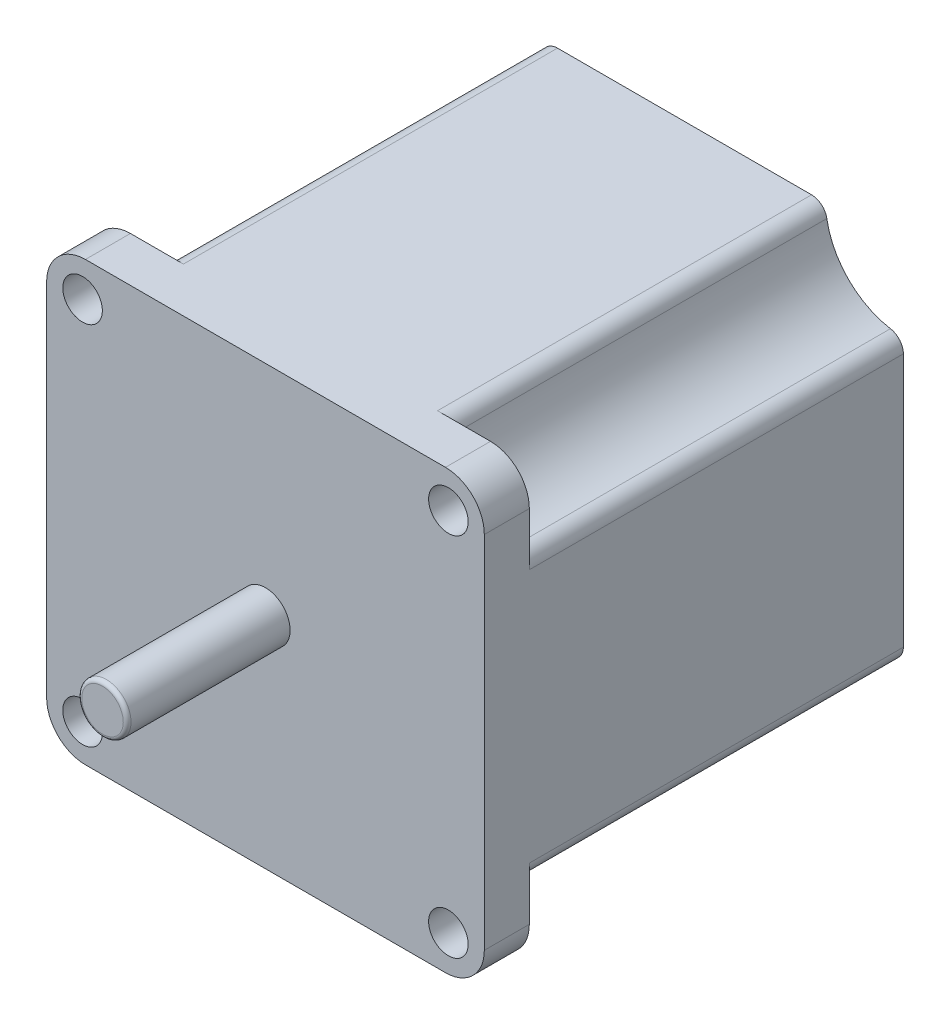
ISO-10303-21;
HEADER;
FILE_DESCRIPTION(('STEP AP214'),'2;1');
FILE_NAME('part.step','',(''),(''),'','','');
FILE_SCHEMA(('AUTOMOTIVE_DESIGN { 1 0 10303 214 1 1 1 1 }'));
ENDSEC;
DATA;
#1=APPLICATION_CONTEXT('core data for automotive mechanical design processes');
#2=APPLICATION_PROTOCOL_DEFINITION('international standard','automotive_design',2000,#1);
#3=PRODUCT_CONTEXT('',#1,'mechanical');
#4=PRODUCT('Part','Part','',(#3));
#5=PRODUCT_RELATED_PRODUCT_CATEGORY('part','',(#4));
#6=PRODUCT_DEFINITION_FORMATION('','',#4);
#7=PRODUCT_DEFINITION_CONTEXT('part definition',#1,'design');
#8=PRODUCT_DEFINITION('design','',#6,#7);
#9=PRODUCT_DEFINITION_SHAPE('','',#8);
#10=(LENGTH_UNIT() NAMED_UNIT(*) SI_UNIT(.MILLI.,.METRE.));
#11=(NAMED_UNIT(*) PLANE_ANGLE_UNIT() SI_UNIT($,.RADIAN.));
#12=(NAMED_UNIT(*) SI_UNIT($,.STERADIAN.) SOLID_ANGLE_UNIT());
#13=UNCERTAINTY_MEASURE_WITH_UNIT(LENGTH_MEASURE(1.E-05),#10,'distance_accuracy_value','');
#14=(GEOMETRIC_REPRESENTATION_CONTEXT(3) GLOBAL_UNCERTAINTY_ASSIGNED_CONTEXT((#13)) GLOBAL_UNIT_ASSIGNED_CONTEXT((#10,
#11,#12)) REPRESENTATION_CONTEXT('',''));
#15=CARTESIAN_POINT('',(0.,0.,0.));
#16=DIRECTION('',(0.,0.,1.));
#17=DIRECTION('',(1.,0.,0.));
#18=AXIS2_PLACEMENT_3D('',#15,#16,#17);
#19=CARTESIAN_POINT('',(0.,0.,54.));
#20=DIRECTION('',(0.,0.,-1.));
#21=DIRECTION('',(-1.,0.,0.));
#22=AXIS2_PLACEMENT_3D('',#19,#20,#21);
#23=PLANE('',#22);
#24=DIRECTION('',(0.,-1.,0.));
#25=VECTOR('',#24,1.);
#26=CARTESIAN_POINT('',(-28.2,28.2,54.));
#27=LINE('',#26,#25);
#28=CARTESIAN_POINT('',(-28.2,23.2,54.));
#29=VERTEX_POINT('',#28);
#30=CARTESIAN_POINT('',(-28.2,-23.2,54.));
#31=VERTEX_POINT('',#30);
#32=EDGE_CURVE('E518',#29,#31,#27,.T.);
#33=ORIENTED_EDGE('',*,*,#32,.T.);
#34=CARTESIAN_POINT('',(-23.2,-23.2,54.));
#35=DIRECTION('',(0.,0.,-1.));
#36=DIRECTION('',(-1.,0.,0.));
#37=AXIS2_PLACEMENT_3D('',#34,#35,#36);
#38=CIRCLE('',#37,5.);
#39=CARTESIAN_POINT('',(-23.2,-28.2,54.));
#40=VERTEX_POINT('',#39);
#41=EDGE_CURVE('E263',#31,#40,#38,.F.);
#42=ORIENTED_EDGE('',*,*,#41,.T.);
#43=DIRECTION('',(1.,0.,0.));
#44=VECTOR('',#43,1.);
#45=CARTESIAN_POINT('',(28.2,-28.2,54.));
#46=LINE('',#45,#44);
#47=CARTESIAN_POINT('',(23.2,-28.2,54.));
#48=VERTEX_POINT('',#47);
#49=EDGE_CURVE('E520',#40,#48,#46,.T.);
#50=ORIENTED_EDGE('',*,*,#49,.T.);
#51=CARTESIAN_POINT('',(23.2,-23.2,54.));
#52=DIRECTION('',(0.,0.,-1.));
#53=DIRECTION('',(-1.,0.,0.));
#54=AXIS2_PLACEMENT_3D('',#51,#52,#53);
#55=CIRCLE('',#54,5.);
#56=CARTESIAN_POINT('',(28.2,-23.2,54.));
#57=VERTEX_POINT('',#56);
#58=EDGE_CURVE('E243',#48,#57,#55,.F.);
#59=ORIENTED_EDGE('',*,*,#58,.T.);
#60=DIRECTION('',(0.,1.,0.));
#61=VECTOR('',#60,1.);
#62=CARTESIAN_POINT('',(28.2,28.2,54.));
#63=LINE('',#62,#61);
#64=CARTESIAN_POINT('',(28.2,23.2,54.));
#65=VERTEX_POINT('',#64);
#66=EDGE_CURVE('E511',#57,#65,#63,.T.);
#67=ORIENTED_EDGE('',*,*,#66,.T.);
#68=CARTESIAN_POINT('',(23.2,23.2,54.));
#69=DIRECTION('',(0.,0.,-1.));
#70=DIRECTION('',(-1.,0.,0.));
#71=AXIS2_PLACEMENT_3D('',#68,#69,#70);
#72=CIRCLE('',#71,5.);
#73=CARTESIAN_POINT('',(23.2,28.2,54.));
#74=VERTEX_POINT('',#73);
#75=EDGE_CURVE('E248',#65,#74,#72,.F.);
#76=ORIENTED_EDGE('',*,*,#75,.T.);
#77=DIRECTION('',(-1.,0.,0.));
#78=VECTOR('',#77,1.);
#79=CARTESIAN_POINT('',(28.2,28.2,54.));
#80=LINE('',#79,#78);
#81=CARTESIAN_POINT('',(-23.2,28.2,54.));
#82=VERTEX_POINT('',#81);
#83=EDGE_CURVE('E514',#74,#82,#80,.T.);
#84=ORIENTED_EDGE('',*,*,#83,.T.);
#85=CARTESIAN_POINT('',(-23.2,23.2,54.));
#86=DIRECTION('',(0.,0.,-1.));
#87=DIRECTION('',(-1.,0.,0.));
#88=AXIS2_PLACEMENT_3D('',#85,#86,#87);
#89=CIRCLE('',#88,5.);
#90=EDGE_CURVE('E256',#82,#29,#89,.F.);
#91=ORIENTED_EDGE('',*,*,#90,.T.);
#92=EDGE_LOOP('',(#33,#42,#50,#59,#67,#76,#84,#91));
#93=FACE_BOUND('',#92,.T.);
#94=CARTESIAN_POINT('',(-23.57,23.57,54.));
#95=DIRECTION('',(0.,0.,1.));
#96=DIRECTION('',(1.,0.,0.));
#97=AXIS2_PLACEMENT_3D('',#94,#95,#96);
#98=CIRCLE('',#97,2.55);
#99=CARTESIAN_POINT('',(-21.02,23.57,54.));
#100=VERTEX_POINT('',#99);
#101=EDGE_CURVE('E507',#100,#100,#98,.T.);
#102=ORIENTED_EDGE('',*,*,#101,.F.);
#103=EDGE_LOOP('',(#102));
#104=FACE_BOUND('',#103,.T.);
#105=CARTESIAN_POINT('',(23.57,23.5700000000013,54.));
#106=DIRECTION('',(0.,0.,1.));
#107=DIRECTION('',(1.,0.,0.));
#108=AXIS2_PLACEMENT_3D('',#105,#106,#107);
#109=CIRCLE('',#108,2.55000000000138);
#110=CARTESIAN_POINT('',(26.1200000000014,23.5700000000013,54.));
#111=VERTEX_POINT('',#110);
#112=EDGE_CURVE('E504',#111,#111,#109,.T.);
#113=ORIENTED_EDGE('',*,*,#112,.F.);
#114=EDGE_LOOP('',(#113));
#115=FACE_BOUND('',#114,.T.);
#116=CARTESIAN_POINT('',(23.5700000000013,-23.5699999999987,54.));
#117=DIRECTION('',(0.,0.,1.));
#118=DIRECTION('',(1.,0.,0.));
#119=AXIS2_PLACEMENT_3D('',#116,#117,#118);
#120=CIRCLE('',#119,2.55000000000187);
#121=CARTESIAN_POINT('',(26.1200000000032,-23.5699999999987,54.));
#122=VERTEX_POINT('',#121);
#123=EDGE_CURVE('E501',#122,#122,#120,.T.);
#124=ORIENTED_EDGE('',*,*,#123,.F.);
#125=EDGE_LOOP('',(#124));
#126=FACE_BOUND('',#125,.T.);
#127=CARTESIAN_POINT('',(-23.5699999999987,-23.57,54.));
#128=DIRECTION('',(0.,0.,1.));
#129=DIRECTION('',(1.,0.,0.));
#130=AXIS2_PLACEMENT_3D('',#127,#128,#129);
#131=CIRCLE('',#130,2.5500000000007);
#132=CARTESIAN_POINT('',(-21.019999999998,-23.57,54.));
#133=VERTEX_POINT('',#132);
#134=EDGE_CURVE('E498',#133,#133,#131,.T.);
#135=ORIENTED_EDGE('',*,*,#134,.F.);
#136=EDGE_LOOP('',(#135));
#137=FACE_BOUND('',#136,.T.);
#138=CARTESIAN_POINT('',(0.,0.,54.));
#139=DIRECTION('',(0.,0.,-1.));
#140=DIRECTION('',(-1.,0.,0.));
#141=AXIS2_PLACEMENT_3D('',#138,#139,#140);
#142=CIRCLE('',#141,3.175);
#143=CARTESIAN_POINT('',(-3.175,0.,54.));
#144=VERTEX_POINT('',#143);
#145=EDGE_CURVE('E350',#144,#144,#142,.F.);
#146=ORIENTED_EDGE('',*,*,#145,.F.);
#147=EDGE_LOOP('',(#146));
#148=FACE_BOUND('',#147,.T.);
#149=ADVANCED_FACE('F53',(#93,#104,#115,#126,#137,#148),#23,.F.);
#150=CARTESIAN_POINT('',(23.5700000000013,-23.5699999999987,0.));
#151=DIRECTION('',(0.,0.,1.));
#152=DIRECTION('',(1.,0.,0.));
#153=AXIS2_PLACEMENT_3D('',#150,#151,#152);
#154=CYLINDRICAL_SURFACE('',#153,2.55000000000187);
#155=ORIENTED_EDGE('',*,*,#123,.T.);
#156=EDGE_LOOP('',(#155));
#157=FACE_BOUND('',#156,.T.);
#158=CARTESIAN_POINT('',(23.5700000000013,-23.5699999999987,48.2));
#159=DIRECTION('',(0.,0.,-1.));
#160=DIRECTION('',(-1.,0.,0.));
#161=AXIS2_PLACEMENT_3D('',#158,#159,#160);
#162=CIRCLE('',#161,2.55000000000187);
#163=CARTESIAN_POINT('',(21.0199999999995,-23.5699999999987,48.2));
#164=VERTEX_POINT('',#163);
#165=EDGE_CURVE('E239',#164,#164,#162,.F.);
#166=ORIENTED_EDGE('',*,*,#165,.F.);
#167=EDGE_LOOP('',(#166));
#168=FACE_BOUND('',#167,.T.);
#169=ADVANCED_FACE('F366',(#157,#168),#154,.F.);
#170=CARTESIAN_POINT('',(23.2,-23.2,54.));
#171=DIRECTION('',(0.,0.,-1.));
#172=DIRECTION('',(-1.,0.,0.));
#173=AXIS2_PLACEMENT_3D('',#170,#171,#172);
#174=CYLINDRICAL_SURFACE('',#173,5.);
#175=DIRECTION('',(0.,0.,-1.));
#176=VECTOR('',#175,1.);
#177=CARTESIAN_POINT('',(23.2,-28.2,54.));
#178=LINE('',#177,#176);
#179=CARTESIAN_POINT('',(23.2,-28.2000000000011,48.2));
#180=VERTEX_POINT('',#179);
#181=EDGE_CURVE('E234',#180,#48,#178,.F.);
#182=ORIENTED_EDGE('',*,*,#181,.F.);
#183=CARTESIAN_POINT('',(23.2,-23.2,48.2));
#184=DIRECTION('',(0.,0.,-1.));
#185=DIRECTION('',(-1.,0.,0.));
#186=AXIS2_PLACEMENT_3D('',#183,#184,#185);
#187=CIRCLE('',#186,5.);
#188=CARTESIAN_POINT('',(28.2,-23.2,48.2));
#189=VERTEX_POINT('',#188);
#190=EDGE_CURVE('E215',#180,#189,#187,.F.);
#191=ORIENTED_EDGE('',*,*,#190,.T.);
#192=DIRECTION('',(0.,0.,-1.));
#193=VECTOR('',#192,1.);
#194=CARTESIAN_POINT('',(28.2,-23.2,54.));
#195=LINE('',#194,#193);
#196=EDGE_CURVE('E244',#57,#189,#195,.T.);
#197=ORIENTED_EDGE('',*,*,#196,.F.);
#198=ORIENTED_EDGE('',*,*,#58,.F.);
#199=EDGE_LOOP('',(#182,#191,#197,#198));
#200=FACE_BOUND('',#199,.T.);
#201=ADVANCED_FACE('F242',(#200),#174,.T.);
#202=CARTESIAN_POINT('',(23.57,23.5700000000013,0.));
#203=DIRECTION('',(0.,0.,1.));
#204=DIRECTION('',(1.,0.,0.));
#205=AXIS2_PLACEMENT_3D('',#202,#203,#204);
#206=CYLINDRICAL_SURFACE('',#205,2.55000000000138);
#207=ORIENTED_EDGE('',*,*,#112,.T.);
#208=EDGE_LOOP('',(#207));
#209=FACE_BOUND('',#208,.T.);
#210=CARTESIAN_POINT('',(23.57,23.5700000000013,48.2));
#211=DIRECTION('',(0.,0.,-1.));
#212=DIRECTION('',(-1.,0.,0.));
#213=AXIS2_PLACEMENT_3D('',#210,#211,#212);
#214=CIRCLE('',#213,2.55000000000138);
#215=CARTESIAN_POINT('',(21.0199999999986,23.5700000000013,48.2));
#216=VERTEX_POINT('',#215);
#217=EDGE_CURVE('E463',#216,#216,#214,.F.);
#218=ORIENTED_EDGE('',*,*,#217,.F.);
#219=EDGE_LOOP('',(#218));
#220=FACE_BOUND('',#219,.T.);
#221=ADVANCED_FACE('F403',(#209,#220),#206,.F.);
#222=CARTESIAN_POINT('',(23.2,23.2,54.));
#223=DIRECTION('',(0.,0.,-1.));
#224=DIRECTION('',(-1.,0.,0.));
#225=AXIS2_PLACEMENT_3D('',#222,#223,#224);
#226=CYLINDRICAL_SURFACE('',#225,5.);
#227=DIRECTION('',(0.,0.,-1.));
#228=VECTOR('',#227,1.);
#229=CARTESIAN_POINT('',(28.2,23.2,54.));
#230=LINE('',#229,#228);
#231=CARTESIAN_POINT('',(28.1999999999997,23.2,48.2));
#232=VERTEX_POINT('',#231);
#233=EDGE_CURVE('E533',#232,#65,#230,.F.);
#234=ORIENTED_EDGE('',*,*,#233,.F.);
#235=CARTESIAN_POINT('',(23.2,23.2,48.2));
#236=DIRECTION('',(0.,0.,-1.));
#237=DIRECTION('',(-1.,0.,0.));
#238=AXIS2_PLACEMENT_3D('',#235,#236,#237);
#239=CIRCLE('',#238,5.);
#240=CARTESIAN_POINT('',(23.2,28.2,48.2));
#241=VERTEX_POINT('',#240);
#242=EDGE_CURVE('E228',#232,#241,#239,.F.);
#243=ORIENTED_EDGE('',*,*,#242,.T.);
#244=DIRECTION('',(0.,0.,-1.));
#245=VECTOR('',#244,1.);
#246=CARTESIAN_POINT('',(23.2,28.2,54.));
#247=LINE('',#246,#245);
#248=EDGE_CURVE('E522',#74,#241,#247,.T.);
#249=ORIENTED_EDGE('',*,*,#248,.F.);
#250=ORIENTED_EDGE('',*,*,#75,.F.);
#251=EDGE_LOOP('',(#234,#243,#249,#250));
#252=FACE_BOUND('',#251,.T.);
#253=ADVANCED_FACE('F399',(#252),#226,.T.);
#254=CARTESIAN_POINT('',(-23.5699999999987,-23.57,0.));
#255=DIRECTION('',(0.,0.,1.));
#256=DIRECTION('',(1.,0.,0.));
#257=AXIS2_PLACEMENT_3D('',#254,#255,#256);
#258=CYLINDRICAL_SURFACE('',#257,2.5500000000007);
#259=ORIENTED_EDGE('',*,*,#134,.T.);
#260=EDGE_LOOP('',(#259));
#261=FACE_BOUND('',#260,.T.);
#262=CARTESIAN_POINT('',(-23.5699999999987,-23.57,48.2));
#263=DIRECTION('',(0.,0.,-1.));
#264=DIRECTION('',(-1.,0.,0.));
#265=AXIS2_PLACEMENT_3D('',#262,#263,#264);
#266=CIRCLE('',#265,2.5500000000007);
#267=CARTESIAN_POINT('',(-26.1199999999994,-23.57,48.2));
#268=VERTEX_POINT('',#267);
#269=EDGE_CURVE('E476',#268,#268,#266,.F.);
#270=ORIENTED_EDGE('',*,*,#269,.F.);
#271=EDGE_LOOP('',(#270));
#272=FACE_BOUND('',#271,.T.);
#273=ADVANCED_FACE('F402',(#261,#272),#258,.F.);
#274=CARTESIAN_POINT('',(-23.2,-23.2,54.));
#275=DIRECTION('',(0.,0.,-1.));
#276=DIRECTION('',(-1.,0.,0.));
#277=AXIS2_PLACEMENT_3D('',#274,#275,#276);
#278=CYLINDRICAL_SURFACE('',#277,5.);
#279=DIRECTION('',(0.,0.,-1.));
#280=VECTOR('',#279,1.);
#281=CARTESIAN_POINT('',(-28.2,-23.2,54.));
#282=LINE('',#281,#280);
#283=CARTESIAN_POINT('',(-28.2000000000013,-23.2,48.2));
#284=VERTEX_POINT('',#283);
#285=EDGE_CURVE('E261',#284,#31,#282,.F.);
#286=ORIENTED_EDGE('',*,*,#285,.F.);
#287=CARTESIAN_POINT('',(-23.2,-23.2,48.2));
#288=DIRECTION('',(0.,0.,-1.));
#289=DIRECTION('',(-1.,0.,0.));
#290=AXIS2_PLACEMENT_3D('',#287,#288,#289);
#291=CIRCLE('',#290,5.);
#292=CARTESIAN_POINT('',(-23.2,-28.2,48.2));
#293=VERTEX_POINT('',#292);
#294=EDGE_CURVE('E268',#284,#293,#291,.F.);
#295=ORIENTED_EDGE('',*,*,#294,.T.);
#296=DIRECTION('',(0.,0.,-1.));
#297=VECTOR('',#296,1.);
#298=CARTESIAN_POINT('',(-23.2,-28.2,54.));
#299=LINE('',#298,#297);
#300=EDGE_CURVE('E258',#40,#293,#299,.T.);
#301=ORIENTED_EDGE('',*,*,#300,.F.);
#302=ORIENTED_EDGE('',*,*,#41,.F.);
#303=EDGE_LOOP('',(#286,#295,#301,#302));
#304=FACE_BOUND('',#303,.T.);
#305=ADVANCED_FACE('F410',(#304),#278,.T.);
#306=CARTESIAN_POINT('',(-23.57,23.57,0.));
#307=DIRECTION('',(0.,0.,1.));
#308=DIRECTION('',(1.,0.,0.));
#309=AXIS2_PLACEMENT_3D('',#306,#307,#308);
#310=CYLINDRICAL_SURFACE('',#309,2.55);
#311=ORIENTED_EDGE('',*,*,#101,.T.);
#312=EDGE_LOOP('',(#311));
#313=FACE_BOUND('',#312,.T.);
#314=CARTESIAN_POINT('',(-23.57,23.57,48.2));
#315=DIRECTION('',(0.,0.,-1.));
#316=DIRECTION('',(-1.,0.,0.));
#317=AXIS2_PLACEMENT_3D('',#314,#315,#316);
#318=CIRCLE('',#317,2.55);
#319=CARTESIAN_POINT('',(-26.12,23.57,48.2));
#320=VERTEX_POINT('',#319);
#321=EDGE_CURVE('E493',#320,#320,#318,.F.);
#322=ORIENTED_EDGE('',*,*,#321,.F.);
#323=EDGE_LOOP('',(#322));
#324=FACE_BOUND('',#323,.T.);
#325=ADVANCED_FACE('F378',(#313,#324),#310,.F.);
#326=CARTESIAN_POINT('',(-23.2,23.2,54.));
#327=DIRECTION('',(0.,0.,-1.));
#328=DIRECTION('',(-1.,0.,0.));
#329=AXIS2_PLACEMENT_3D('',#326,#327,#328);
#330=CYLINDRICAL_SURFACE('',#329,5.);
#331=DIRECTION('',(0.,0.,-1.));
#332=VECTOR('',#331,1.);
#333=CARTESIAN_POINT('',(-23.2,28.2,54.));
#334=LINE('',#333,#332);
#335=CARTESIAN_POINT('',(-23.2,28.2,48.2));
#336=VERTEX_POINT('',#335);
#337=EDGE_CURVE('E254',#336,#82,#334,.F.);
#338=ORIENTED_EDGE('',*,*,#337,.F.);
#339=CARTESIAN_POINT('',(-23.2,23.2,48.2));
#340=DIRECTION('',(0.,0.,-1.));
#341=DIRECTION('',(-1.,0.,0.));
#342=AXIS2_PLACEMENT_3D('',#339,#340,#341);
#343=CIRCLE('',#342,5.);
#344=CARTESIAN_POINT('',(-28.2,23.2,48.2));
#345=VERTEX_POINT('',#344);
#346=EDGE_CURVE('E265',#336,#345,#343,.F.);
#347=ORIENTED_EDGE('',*,*,#346,.T.);
#348=DIRECTION('',(0.,0.,-1.));
#349=VECTOR('',#348,1.);
#350=CARTESIAN_POINT('',(-28.2,23.2,54.));
#351=LINE('',#350,#349);
#352=EDGE_CURVE('E246',#29,#345,#351,.T.);
#353=ORIENTED_EDGE('',*,*,#352,.F.);
#354=ORIENTED_EDGE('',*,*,#90,.F.);
#355=EDGE_LOOP('',(#338,#347,#353,#354));
#356=FACE_BOUND('',#355,.T.);
#357=ADVANCED_FACE('F397',(#356),#330,.T.);
#358=CARTESIAN_POINT('',(28.2,28.2,54.));
#359=DIRECTION('',(-1.,0.,0.));
#360=DIRECTION('',(0.,-1.,0.));
#361=AXIS2_PLACEMENT_3D('',#358,#359,#360);
#362=PLANE('',#361);
#363=DIRECTION('',(0.,-1.,0.));
#364=VECTOR('',#363,1.);
#365=CARTESIAN_POINT('',(28.1999999999984,-18.2000000000011,48.2));
#366=LINE('',#365,#364);
#367=CARTESIAN_POINT('',(28.1999999999984,-16.3678404338015,48.2));
#368=VERTEX_POINT('',#367);
#369=EDGE_CURVE('E222',#368,#189,#366,.T.);
#370=ORIENTED_EDGE('',*,*,#369,.F.);
#371=DIRECTION('',(0.,0.,-1.));
#372=VECTOR('',#371,1.);
#373=CARTESIAN_POINT('',(28.2,-16.3678404338015,54.));
#374=LINE('',#373,#372);
#375=CARTESIAN_POINT('',(28.2,-16.3678404338015,0.));
#376=VERTEX_POINT('',#375);
#377=EDGE_CURVE('E343',#368,#376,#374,.T.);
#378=ORIENTED_EDGE('',*,*,#377,.T.);
#379=DIRECTION('',(0.,1.,0.));
#380=VECTOR('',#379,1.);
#381=CARTESIAN_POINT('',(28.2,28.2,0.));
#382=LINE('',#381,#380);
#383=CARTESIAN_POINT('',(28.2,16.3678404337994,0.));
#384=VERTEX_POINT('',#383);
#385=EDGE_CURVE('E510',#376,#384,#382,.T.);
#386=ORIENTED_EDGE('',*,*,#385,.T.);
#387=DIRECTION('',(0.,0.,-1.));
#388=VECTOR('',#387,1.);
#389=CARTESIAN_POINT('',(28.2,16.3678404337994,54.));
#390=LINE('',#389,#388);
#391=CARTESIAN_POINT('',(28.1999999999997,16.3678404337994,48.2));
#392=VERTEX_POINT('',#391);
#393=EDGE_CURVE('E290',#384,#392,#390,.F.);
#394=ORIENTED_EDGE('',*,*,#393,.T.);
#395=DIRECTION('',(0.,1.,0.));
#396=VECTOR('',#395,1.);
#397=CARTESIAN_POINT('',(28.1999999999997,18.1999999999987,48.2));
#398=LINE('',#397,#396);
#399=EDGE_CURVE('E464',#392,#232,#398,.T.);
#400=ORIENTED_EDGE('',*,*,#399,.T.);
#401=ORIENTED_EDGE('',*,*,#233,.T.);
#402=ORIENTED_EDGE('',*,*,#66,.F.);
#403=ORIENTED_EDGE('',*,*,#196,.T.);
#404=EDGE_LOOP('',(#370,#378,#386,#394,#400,#401,#402,#403));
#405=FACE_BOUND('',#404,.T.);
#406=ADVANCED_FACE('F393',(#405),#362,.F.);
#407=CARTESIAN_POINT('',(28.2,28.2,54.));
#408=DIRECTION('',(0.,-1.,0.));
#409=DIRECTION('',(1.,0.,0.));
#410=AXIS2_PLACEMENT_3D('',#407,#408,#409);
#411=PLANE('',#410);
#412=DIRECTION('',(-1.,0.,0.));
#413=VECTOR('',#412,1.);
#414=CARTESIAN_POINT('',(28.2,28.2,0.));
#415=LINE('',#414,#413);
#416=CARTESIAN_POINT('',(16.3678404338003,28.2,0.));
#417=VERTEX_POINT('',#416);
#418=CARTESIAN_POINT('',(-16.3678404338008,28.2,0.));
#419=VERTEX_POINT('',#418);
#420=EDGE_CURVE('E524',#417,#419,#415,.T.);
#421=ORIENTED_EDGE('',*,*,#420,.T.);
#422=DIRECTION('',(0.,0.,-1.));
#423=VECTOR('',#422,1.);
#424=CARTESIAN_POINT('',(-16.3678404338008,28.2,54.));
#425=LINE('',#424,#423);
#426=CARTESIAN_POINT('',(-16.3678404338008,28.2,48.2));
#427=VERTEX_POINT('',#426);
#428=EDGE_CURVE('E300',#419,#427,#425,.F.);
#429=ORIENTED_EDGE('',*,*,#428,.T.);
#430=DIRECTION('',(1.,0.,0.));
#431=VECTOR('',#430,1.);
#432=CARTESIAN_POINT('',(-28.2,28.2,48.2));
#433=LINE('',#432,#431);
#434=EDGE_CURVE('E486',#336,#427,#433,.T.);
#435=ORIENTED_EDGE('',*,*,#434,.F.);
#436=ORIENTED_EDGE('',*,*,#337,.T.);
#437=ORIENTED_EDGE('',*,*,#83,.F.);
#438=ORIENTED_EDGE('',*,*,#248,.T.);
#439=DIRECTION('',(-1.,0.,0.));
#440=VECTOR('',#439,1.);
#441=CARTESIAN_POINT('',(28.1999999999997,28.1999999999987,48.2));
#442=LINE('',#441,#440);
#443=CARTESIAN_POINT('',(16.3678404338003,28.1999999999987,48.2));
#444=VERTEX_POINT('',#443);
#445=EDGE_CURVE('E466',#241,#444,#442,.T.);
#446=ORIENTED_EDGE('',*,*,#445,.T.);
#447=DIRECTION('',(0.,0.,-1.));
#448=VECTOR('',#447,1.);
#449=CARTESIAN_POINT('',(16.3678404338003,28.2,54.));
#450=LINE('',#449,#448);
#451=EDGE_CURVE('E227',#444,#417,#450,.T.);
#452=ORIENTED_EDGE('',*,*,#451,.T.);
#453=EDGE_LOOP('',(#421,#429,#435,#436,#437,#438,#446,#452));
#454=FACE_BOUND('',#453,.T.);
#455=ADVANCED_FACE('F389',(#454),#411,.F.);
#456=CARTESIAN_POINT('',(-28.2,28.2,54.));
#457=DIRECTION('',(1.,0.,0.));
#458=DIRECTION('',(0.,1.,0.));
#459=AXIS2_PLACEMENT_3D('',#456,#457,#458);
#460=PLANE('',#459);
#461=DIRECTION('',(0.,-1.,0.));
#462=VECTOR('',#461,1.);
#463=CARTESIAN_POINT('',(-28.2,28.2,0.));
#464=LINE('',#463,#462);
#465=CARTESIAN_POINT('',(-28.2,16.3678404338008,0.));
#466=VERTEX_POINT('',#465);
#467=CARTESIAN_POINT('',(-28.2,-16.3678404338007,0.));
#468=VERTEX_POINT('',#467);
#469=EDGE_CURVE('E527',#466,#468,#464,.T.);
#470=ORIENTED_EDGE('',*,*,#469,.T.);
#471=DIRECTION('',(0.,0.,-1.));
#472=VECTOR('',#471,1.);
#473=CARTESIAN_POINT('',(-28.2,-16.3678404338007,54.));
#474=LINE('',#473,#472);
#475=CARTESIAN_POINT('',(-28.2000000000013,-16.3678404338007,48.2));
#476=VERTEX_POINT('',#475);
#477=EDGE_CURVE('E320',#468,#476,#474,.F.);
#478=ORIENTED_EDGE('',*,*,#477,.T.);
#479=DIRECTION('',(0.,1.,0.));
#480=VECTOR('',#479,1.);
#481=CARTESIAN_POINT('',(-28.2000000000013,-28.1999999999997,48.2));
#482=LINE('',#481,#480);
#483=EDGE_CURVE('E477',#284,#476,#482,.T.);
#484=ORIENTED_EDGE('',*,*,#483,.F.);
#485=ORIENTED_EDGE('',*,*,#285,.T.);
#486=ORIENTED_EDGE('',*,*,#32,.F.);
#487=ORIENTED_EDGE('',*,*,#352,.T.);
#488=DIRECTION('',(0.,1.,0.));
#489=VECTOR('',#488,1.);
#490=CARTESIAN_POINT('',(-28.2,18.2,48.2));
#491=LINE('',#490,#489);
#492=CARTESIAN_POINT('',(-28.2,16.3678404338008,48.2));
#493=VERTEX_POINT('',#492);
#494=EDGE_CURVE('E491',#493,#345,#491,.T.);
#495=ORIENTED_EDGE('',*,*,#494,.F.);
#496=DIRECTION('',(0.,0.,-1.));
#497=VECTOR('',#496,1.);
#498=CARTESIAN_POINT('',(-28.2,16.3678404338008,54.));
#499=LINE('',#498,#497);
#500=EDGE_CURVE('E305',#493,#466,#499,.T.);
#501=ORIENTED_EDGE('',*,*,#500,.T.);
#502=EDGE_LOOP('',(#470,#478,#484,#485,#486,#487,#495,#501));
#503=FACE_BOUND('',#502,.T.);
#504=ADVANCED_FACE('F386',(#503),#460,.F.);
#505=CARTESIAN_POINT('',(28.2,-28.2,54.));
#506=DIRECTION('',(0.,1.,0.));
#507=DIRECTION('',(-1.,0.,0.));
#508=AXIS2_PLACEMENT_3D('',#505,#506,#507);
#509=PLANE('',#508);
#510=DIRECTION('',(1.,0.,0.));
#511=VECTOR('',#510,1.);
#512=CARTESIAN_POINT('',(28.2,-28.2,0.));
#513=LINE('',#512,#511);
#514=CARTESIAN_POINT('',(-16.3678404338021,-28.2,0.));
#515=VERTEX_POINT('',#514);
#516=CARTESIAN_POINT('',(16.3678404337993,-28.2,0.));
#517=VERTEX_POINT('',#516);
#518=EDGE_CURVE('E515',#515,#517,#513,.T.);
#519=ORIENTED_EDGE('',*,*,#518,.T.);
#520=DIRECTION('',(0.,0.,-1.));
#521=VECTOR('',#520,1.);
#522=CARTESIAN_POINT('',(16.3678404337993,-28.2,54.));
#523=LINE('',#522,#521);
#524=CARTESIAN_POINT('',(16.3678404337993,-28.2000000000011,48.2));
#525=VERTEX_POINT('',#524);
#526=EDGE_CURVE('E237',#517,#525,#523,.F.);
#527=ORIENTED_EDGE('',*,*,#526,.T.);
#528=DIRECTION('',(-1.,0.,0.));
#529=VECTOR('',#528,1.);
#530=CARTESIAN_POINT('',(28.1999999999984,-28.2000000000011,48.2));
#531=LINE('',#530,#529);
#532=EDGE_CURVE('E219',#180,#525,#531,.T.);
#533=ORIENTED_EDGE('',*,*,#532,.F.);
#534=ORIENTED_EDGE('',*,*,#181,.T.);
#535=ORIENTED_EDGE('',*,*,#49,.F.);
#536=ORIENTED_EDGE('',*,*,#300,.T.);
#537=DIRECTION('',(-1.,0.,0.));
#538=VECTOR('',#537,1.);
#539=CARTESIAN_POINT('',(-18.2000000000013,-28.1999999999997,48.2));
#540=LINE('',#539,#538);
#541=CARTESIAN_POINT('',(-16.3678404338021,-28.1999999999997,48.2));
#542=VERTEX_POINT('',#541);
#543=EDGE_CURVE('E472',#542,#293,#540,.T.);
#544=ORIENTED_EDGE('',*,*,#543,.F.);
#545=DIRECTION('',(0.,0.,-1.));
#546=VECTOR('',#545,1.);
#547=CARTESIAN_POINT('',(-16.3678404338021,-28.2,54.));
#548=LINE('',#547,#546);
#549=EDGE_CURVE('E325',#542,#515,#548,.T.);
#550=ORIENTED_EDGE('',*,*,#549,.T.);
#551=EDGE_LOOP('',(#519,#527,#533,#534,#535,#536,#544,#550));
#552=FACE_BOUND('',#551,.T.);
#553=ADVANCED_FACE('F232',(#552),#509,.F.);
#554=CARTESIAN_POINT('',(0.,0.,0.));
#555=DIRECTION('',(0.,0.,-1.));
#556=DIRECTION('',(-1.,0.,0.));
#557=AXIS2_PLACEMENT_3D('',#554,#555,#556);
#558=PLANE('',#557);
#559=ORIENTED_EDGE('',*,*,#385,.F.);
#560=CARTESIAN_POINT('',(26.2,-16.3678404338015,0.));
#561=DIRECTION('',(0.,0.,-1.));
#562=DIRECTION('',(-1.,0.,0.));
#563=AXIS2_PLACEMENT_3D('',#560,#561,#562);
#564=CIRCLE('',#563,2.);
#565=CARTESIAN_POINT('',(26.5333333333331,-18.3398670281681,0.));
#566=VERTEX_POINT('',#565);
#567=EDGE_CURVE('E76',#376,#566,#564,.T.);
#568=ORIENTED_EDGE('',*,*,#567,.T.);
#569=CARTESIAN_POINT('',(28.1999999999984,-28.2000000000011,0.));
#570=DIRECTION('',(0.,0.,-1.));
#571=DIRECTION('',(-1.,0.,0.));
#572=AXIS2_PLACEMENT_3D('',#569,#570,#571);
#573=CIRCLE('',#572,10.);
#574=CARTESIAN_POINT('',(18.3398670281658,-26.5333333333335,0.));
#575=VERTEX_POINT('',#574);
#576=EDGE_CURVE('E454',#575,#566,#573,.T.);
#577=ORIENTED_EDGE('',*,*,#576,.F.);
#578=CARTESIAN_POINT('',(16.3678404337993,-26.2,0.));
#579=DIRECTION('',(0.,0.,-1.));
#580=DIRECTION('',(-1.,0.,0.));
#581=AXIS2_PLACEMENT_3D('',#578,#579,#580);
#582=CIRCLE('',#581,2.);
#583=EDGE_CURVE('E338',#575,#517,#582,.T.);
#584=ORIENTED_EDGE('',*,*,#583,.T.);
#585=ORIENTED_EDGE('',*,*,#518,.F.);
#586=CARTESIAN_POINT('',(-16.3678404338021,-26.2,0.));
#587=DIRECTION('',(0.,0.,-1.));
#588=DIRECTION('',(-1.,0.,0.));
#589=AXIS2_PLACEMENT_3D('',#586,#587,#588);
#590=CIRCLE('',#589,2.);
#591=CARTESIAN_POINT('',(-18.3398670281686,-26.5333333333333,0.));
#592=VERTEX_POINT('',#591);
#593=EDGE_CURVE('E328',#515,#592,#590,.T.);
#594=ORIENTED_EDGE('',*,*,#593,.T.);
#595=CARTESIAN_POINT('',(-28.2000000000013,-28.1999999999997,0.));
#596=DIRECTION('',(0.,0.,-1.));
#597=DIRECTION('',(-1.,0.,0.));
#598=AXIS2_PLACEMENT_3D('',#595,#596,#597);
#599=CIRCLE('',#598,10.);
#600=CARTESIAN_POINT('',(-26.5333333333336,-18.3398670281672,0.));
#601=VERTEX_POINT('',#600);
#602=EDGE_CURVE('E473',#601,#592,#599,.T.);
#603=ORIENTED_EDGE('',*,*,#602,.F.);
#604=CARTESIAN_POINT('',(-26.2,-16.3678404338007,0.));
#605=DIRECTION('',(0.,0.,-1.));
#606=DIRECTION('',(-1.,0.,0.));
#607=AXIS2_PLACEMENT_3D('',#604,#605,#606);
#608=CIRCLE('',#607,2.);
#609=EDGE_CURVE('E318',#601,#468,#608,.T.);
#610=ORIENTED_EDGE('',*,*,#609,.T.);
#611=ORIENTED_EDGE('',*,*,#469,.F.);
#612=CARTESIAN_POINT('',(-26.2,16.3678404338008,0.));
#613=DIRECTION('',(0.,0.,-1.));
#614=DIRECTION('',(-1.,0.,0.));
#615=AXIS2_PLACEMENT_3D('',#612,#613,#614);
#616=CIRCLE('',#615,2.);
#617=CARTESIAN_POINT('',(-26.5333333333333,18.3398670281673,0.));
#618=VERTEX_POINT('',#617);
#619=EDGE_CURVE('E308',#466,#618,#616,.T.);
#620=ORIENTED_EDGE('',*,*,#619,.T.);
#621=CARTESIAN_POINT('',(-28.2,28.2,0.));
#622=DIRECTION('',(0.,0.,-1.));
#623=DIRECTION('',(-1.,0.,0.));
#624=AXIS2_PLACEMENT_3D('',#621,#622,#623);
#625=CIRCLE('',#624,10.);
#626=CARTESIAN_POINT('',(-18.3398670281673,26.5333333333333,0.));
#627=VERTEX_POINT('',#626);
#628=EDGE_CURVE('E485',#627,#618,#625,.T.);
#629=ORIENTED_EDGE('',*,*,#628,.F.);
#630=CARTESIAN_POINT('',(-16.3678404338008,26.2,0.));
#631=DIRECTION('',(0.,0.,-1.));
#632=DIRECTION('',(-1.,0.,0.));
#633=AXIS2_PLACEMENT_3D('',#630,#631,#632);
#634=CIRCLE('',#633,2.);
#635=EDGE_CURVE('E298',#627,#419,#634,.T.);
#636=ORIENTED_EDGE('',*,*,#635,.T.);
#637=ORIENTED_EDGE('',*,*,#420,.F.);
#638=CARTESIAN_POINT('',(16.3678404338003,26.2,0.));
#639=DIRECTION('',(0.,0.,-1.));
#640=DIRECTION('',(-1.,0.,0.));
#641=AXIS2_PLACEMENT_3D('',#638,#639,#640);
#642=CIRCLE('',#641,2.);
#643=CARTESIAN_POINT('',(18.3398670281668,26.5333333333331,0.));
#644=VERTEX_POINT('',#643);
#645=EDGE_CURVE('E275',#417,#644,#642,.T.);
#646=ORIENTED_EDGE('',*,*,#645,.T.);
#647=CARTESIAN_POINT('',(28.1999999999997,28.1999999999987,0.));
#648=DIRECTION('',(0.,0.,-1.));
#649=DIRECTION('',(-1.,0.,0.));
#650=AXIS2_PLACEMENT_3D('',#647,#648,#649);
#651=CIRCLE('',#650,10.);
#652=CARTESIAN_POINT('',(26.5333333333333,18.3398670281659,0.));
#653=VERTEX_POINT('',#652);
#654=EDGE_CURVE('E461',#653,#644,#651,.T.);
#655=ORIENTED_EDGE('',*,*,#654,.F.);
#656=CARTESIAN_POINT('',(26.2,16.3678404337994,0.));
#657=DIRECTION('',(0.,0.,-1.));
#658=DIRECTION('',(-1.,0.,0.));
#659=AXIS2_PLACEMENT_3D('',#656,#657,#658);
#660=CIRCLE('',#659,2.);
#661=EDGE_CURVE('E287',#653,#384,#660,.T.);
#662=ORIENTED_EDGE('',*,*,#661,.T.);
#663=EDGE_LOOP('',(#559,#568,#577,#584,#585,#594,#603,#610,#611,#620,#629,#636,#637,#646,#655,#662));
#664=FACE_BOUND('',#663,.T.);
#665=ADVANCED_FACE('F380',(#664),#558,.T.);
#666=CARTESIAN_POINT('',(-28.2,28.2,48.2));
#667=DIRECTION('',(0.,0.,-1.));
#668=DIRECTION('',(-1.,0.,0.));
#669=AXIS2_PLACEMENT_3D('',#666,#667,#668);
#670=PLANE('',#669);
#671=ORIENTED_EDGE('',*,*,#434,.T.);
#672=CARTESIAN_POINT('',(-16.3678404338008,26.2,48.2));
#673=DIRECTION('',(0.,0.,-1.));
#674=DIRECTION('',(-1.,0.,0.));
#675=AXIS2_PLACEMENT_3D('',#672,#673,#674);
#676=CIRCLE('',#675,2.);
#677=CARTESIAN_POINT('',(-18.3398670281673,26.5333333333333,48.2));
#678=VERTEX_POINT('',#677);
#679=EDGE_CURVE('E303',#427,#678,#676,.F.);
#680=ORIENTED_EDGE('',*,*,#679,.T.);
#681=CARTESIAN_POINT('',(-28.2,28.2,48.2));
#682=DIRECTION('',(0.,0.,-1.));
#683=DIRECTION('',(-1.,0.,0.));
#684=AXIS2_PLACEMENT_3D('',#681,#682,#683);
#685=CIRCLE('',#684,10.);
#686=CARTESIAN_POINT('',(-26.5333333333333,18.3398670281673,48.2));
#687=VERTEX_POINT('',#686);
#688=EDGE_CURVE('E488',#678,#687,#685,.T.);
#689=ORIENTED_EDGE('',*,*,#688,.T.);
#690=CARTESIAN_POINT('',(-26.2,16.3678404338008,48.2));
#691=DIRECTION('',(0.,0.,-1.));
#692=DIRECTION('',(-1.,0.,0.));
#693=AXIS2_PLACEMENT_3D('',#690,#691,#692);
#694=CIRCLE('',#693,2.);
#695=EDGE_CURVE('E312',#687,#493,#694,.F.);
#696=ORIENTED_EDGE('',*,*,#695,.T.);
#697=ORIENTED_EDGE('',*,*,#494,.T.);
#698=ORIENTED_EDGE('',*,*,#346,.F.);
#699=EDGE_LOOP('',(#671,#680,#689,#696,#697,#698));
#700=FACE_BOUND('',#699,.T.);
#701=ORIENTED_EDGE('',*,*,#321,.T.);
#702=EDGE_LOOP('',(#701));
#703=FACE_BOUND('',#702,.T.);
#704=ADVANCED_FACE('F383',(#700,#703),#670,.T.);
#705=CARTESIAN_POINT('',(-28.2,28.2,48.2));
#706=DIRECTION('',(0.,0.,-1.));
#707=DIRECTION('',(-1.,0.,0.));
#708=AXIS2_PLACEMENT_3D('',#705,#706,#707);
#709=CYLINDRICAL_SURFACE('',#708,10.);
#710=ORIENTED_EDGE('',*,*,#628,.T.);
#711=DIRECTION('',(0.,0.,-1.));
#712=VECTOR('',#711,1.);
#713=CARTESIAN_POINT('',(-26.5333333333333,18.3398670281673,48.2));
#714=LINE('',#713,#712);
#715=EDGE_CURVE('E310',#618,#687,#714,.F.);
#716=ORIENTED_EDGE('',*,*,#715,.T.);
#717=ORIENTED_EDGE('',*,*,#688,.F.);
#718=DIRECTION('',(0.,0.,-1.));
#719=VECTOR('',#718,1.);
#720=CARTESIAN_POINT('',(-18.3398670281673,26.5333333333333,48.2));
#721=LINE('',#720,#719);
#722=EDGE_CURVE('E295',#678,#627,#721,.T.);
#723=ORIENTED_EDGE('',*,*,#722,.T.);
#724=EDGE_LOOP('',(#710,#716,#717,#723));
#725=FACE_BOUND('',#724,.T.);
#726=ADVANCED_FACE('F562',(#725),#709,.F.);
#727=CARTESIAN_POINT('',(-28.2000000000013,-28.1999999999997,48.2));
#728=DIRECTION('',(0.,0.,-1.));
#729=DIRECTION('',(-1.,0.,0.));
#730=AXIS2_PLACEMENT_3D('',#727,#728,#729);
#731=PLANE('',#730);
#732=ORIENTED_EDGE('',*,*,#483,.T.);
#733=CARTESIAN_POINT('',(-26.2,-16.3678404338007,48.2));
#734=DIRECTION('',(0.,0.,-1.));
#735=DIRECTION('',(-1.,0.,0.));
#736=AXIS2_PLACEMENT_3D('',#733,#734,#735);
#737=CIRCLE('',#736,2.);
#738=CARTESIAN_POINT('',(-26.5333333333336,-18.3398670281672,48.2));
#739=VERTEX_POINT('',#738);
#740=EDGE_CURVE('E323',#476,#739,#737,.F.);
#741=ORIENTED_EDGE('',*,*,#740,.T.);
#742=CARTESIAN_POINT('',(-28.2000000000013,-28.1999999999997,48.2));
#743=DIRECTION('',(0.,0.,-1.));
#744=DIRECTION('',(-1.,0.,0.));
#745=AXIS2_PLACEMENT_3D('',#742,#743,#744);
#746=CIRCLE('',#745,10.);
#747=CARTESIAN_POINT('',(-18.3398670281686,-26.5333333333333,48.2));
#748=VERTEX_POINT('',#747);
#749=EDGE_CURVE('E479',#739,#748,#746,.T.);
#750=ORIENTED_EDGE('',*,*,#749,.T.);
#751=CARTESIAN_POINT('',(-16.3678404338021,-26.2,48.2));
#752=DIRECTION('',(0.,0.,-1.));
#753=DIRECTION('',(-1.,0.,0.));
#754=AXIS2_PLACEMENT_3D('',#751,#752,#753);
#755=CIRCLE('',#754,2.);
#756=EDGE_CURVE('E332',#748,#542,#755,.F.);
#757=ORIENTED_EDGE('',*,*,#756,.T.);
#758=ORIENTED_EDGE('',*,*,#543,.T.);
#759=ORIENTED_EDGE('',*,*,#294,.F.);
#760=EDGE_LOOP('',(#732,#741,#750,#757,#758,#759));
#761=FACE_BOUND('',#760,.T.);
#762=ORIENTED_EDGE('',*,*,#269,.T.);
#763=EDGE_LOOP('',(#762));
#764=FACE_BOUND('',#763,.T.);
#765=ADVANCED_FACE('F579',(#761,#764),#731,.T.);
#766=CARTESIAN_POINT('',(-28.2000000000013,-28.1999999999997,48.2));
#767=DIRECTION('',(0.,0.,-1.));
#768=DIRECTION('',(-1.,0.,0.));
#769=AXIS2_PLACEMENT_3D('',#766,#767,#768);
#770=CYLINDRICAL_SURFACE('',#769,10.);
#771=ORIENTED_EDGE('',*,*,#602,.T.);
#772=DIRECTION('',(0.,0.,-1.));
#773=VECTOR('',#772,1.);
#774=CARTESIAN_POINT('',(-18.3398670281686,-26.5333333333333,48.2));
#775=LINE('',#774,#773);
#776=EDGE_CURVE('E330',#592,#748,#775,.F.);
#777=ORIENTED_EDGE('',*,*,#776,.T.);
#778=ORIENTED_EDGE('',*,*,#749,.F.);
#779=DIRECTION('',(0.,0.,-1.));
#780=VECTOR('',#779,1.);
#781=CARTESIAN_POINT('',(-26.5333333333336,-18.3398670281672,48.2));
#782=LINE('',#781,#780);
#783=EDGE_CURVE('E315',#739,#601,#782,.T.);
#784=ORIENTED_EDGE('',*,*,#783,.T.);
#785=EDGE_LOOP('',(#771,#777,#778,#784));
#786=FACE_BOUND('',#785,.T.);
#787=ADVANCED_FACE('F575',(#786),#770,.F.);
#788=CARTESIAN_POINT('',(28.1999999999997,28.1999999999987,48.2));
#789=DIRECTION('',(0.,0.,-1.));
#790=DIRECTION('',(-1.,0.,0.));
#791=AXIS2_PLACEMENT_3D('',#788,#789,#790);
#792=PLANE('',#791);
#793=ORIENTED_EDGE('',*,*,#399,.F.);
#794=CARTESIAN_POINT('',(26.2,16.3678404337994,48.2));
#795=DIRECTION('',(0.,0.,-1.));
#796=DIRECTION('',(-1.,0.,0.));
#797=AXIS2_PLACEMENT_3D('',#794,#795,#796);
#798=CIRCLE('',#797,2.);
#799=CARTESIAN_POINT('',(26.5333333333333,18.3398670281659,48.2));
#800=VERTEX_POINT('',#799);
#801=EDGE_CURVE('E293',#392,#800,#798,.F.);
#802=ORIENTED_EDGE('',*,*,#801,.T.);
#803=CARTESIAN_POINT('',(28.1999999999997,28.1999999999987,48.2));
#804=DIRECTION('',(0.,0.,-1.));
#805=DIRECTION('',(-1.,0.,0.));
#806=AXIS2_PLACEMENT_3D('',#803,#804,#805);
#807=CIRCLE('',#806,10.);
#808=CARTESIAN_POINT('',(18.3398670281668,26.5333333333331,48.2));
#809=VERTEX_POINT('',#808);
#810=EDGE_CURVE('E460',#800,#809,#807,.T.);
#811=ORIENTED_EDGE('',*,*,#810,.T.);
#812=CARTESIAN_POINT('',(16.3678404338003,26.2,48.2));
#813=DIRECTION('',(0.,0.,-1.));
#814=DIRECTION('',(-1.,0.,0.));
#815=AXIS2_PLACEMENT_3D('',#812,#813,#814);
#816=CIRCLE('',#815,2.);
#817=EDGE_CURVE('E281',#809,#444,#816,.F.);
#818=ORIENTED_EDGE('',*,*,#817,.T.);
#819=ORIENTED_EDGE('',*,*,#445,.F.);
#820=ORIENTED_EDGE('',*,*,#242,.F.);
#821=EDGE_LOOP('',(#793,#802,#811,#818,#819,#820));
#822=FACE_BOUND('',#821,.T.);
#823=ORIENTED_EDGE('',*,*,#217,.T.);
#824=EDGE_LOOP('',(#823));
#825=FACE_BOUND('',#824,.T.);
#826=ADVANCED_FACE('F543',(#822,#825),#792,.T.);
#827=CARTESIAN_POINT('',(28.1999999999997,28.1999999999987,48.2));
#828=DIRECTION('',(0.,0.,-1.));
#829=DIRECTION('',(-1.,0.,0.));
#830=AXIS2_PLACEMENT_3D('',#827,#828,#829);
#831=CYLINDRICAL_SURFACE('',#830,10.);
#832=ORIENTED_EDGE('',*,*,#810,.F.);
#833=DIRECTION('',(0.,0.,-1.));
#834=VECTOR('',#833,1.);
#835=CARTESIAN_POINT('',(26.5333333333333,18.3398670281659,48.2));
#836=LINE('',#835,#834);
#837=EDGE_CURVE('E284',#800,#653,#836,.T.);
#838=ORIENTED_EDGE('',*,*,#837,.T.);
#839=ORIENTED_EDGE('',*,*,#654,.T.);
#840=DIRECTION('',(0.,0.,-1.));
#841=VECTOR('',#840,1.);
#842=CARTESIAN_POINT('',(18.3398670281668,26.5333333333331,48.2));
#843=LINE('',#842,#841);
#844=EDGE_CURVE('E278',#644,#809,#843,.F.);
#845=ORIENTED_EDGE('',*,*,#844,.T.);
#846=EDGE_LOOP('',(#832,#838,#839,#845));
#847=FACE_BOUND('',#846,.T.);
#848=ADVANCED_FACE('F550',(#847),#831,.F.);
#849=CARTESIAN_POINT('',(0.,0.,48.2));
#850=DIRECTION('',(0.,0.,-1.));
#851=DIRECTION('',(-1.,0.,0.));
#852=AXIS2_PLACEMENT_3D('',#849,#850,#851);
#853=PLANE('',#852);
#854=ORIENTED_EDGE('',*,*,#532,.T.);
#855=CARTESIAN_POINT('',(16.3678404337993,-26.2,48.2));
#856=DIRECTION('',(0.,0.,-1.));
#857=DIRECTION('',(-1.,0.,0.));
#858=AXIS2_PLACEMENT_3D('',#855,#856,#857);
#859=CIRCLE('',#858,2.);
#860=CARTESIAN_POINT('',(18.3398670281658,-26.5333333333335,48.2));
#861=VERTEX_POINT('',#860);
#862=EDGE_CURVE('E341',#525,#861,#859,.F.);
#863=ORIENTED_EDGE('',*,*,#862,.T.);
#864=CARTESIAN_POINT('',(28.1999999999984,-28.2000000000011,48.2));
#865=DIRECTION('',(0.,0.,-1.));
#866=DIRECTION('',(-1.,0.,0.));
#867=AXIS2_PLACEMENT_3D('',#864,#865,#866);
#868=CIRCLE('',#867,10.);
#869=CARTESIAN_POINT('',(26.5333333333331,-18.3398670281681,48.2));
#870=VERTEX_POINT('',#869);
#871=EDGE_CURVE('E452',#861,#870,#868,.T.);
#872=ORIENTED_EDGE('',*,*,#871,.T.);
#873=CARTESIAN_POINT('',(26.2,-16.3678404338015,48.2));
#874=DIRECTION('',(0.,0.,-1.));
#875=DIRECTION('',(-1.,0.,0.));
#876=AXIS2_PLACEMENT_3D('',#873,#874,#875);
#877=CIRCLE('',#876,2.);
#878=EDGE_CURVE('E348',#870,#368,#877,.F.);
#879=ORIENTED_EDGE('',*,*,#878,.T.);
#880=ORIENTED_EDGE('',*,*,#369,.T.);
#881=ORIENTED_EDGE('',*,*,#190,.F.);
#882=EDGE_LOOP('',(#854,#863,#872,#879,#880,#881));
#883=FACE_BOUND('',#882,.T.);
#884=ORIENTED_EDGE('',*,*,#165,.T.);
#885=EDGE_LOOP('',(#884));
#886=FACE_BOUND('',#885,.T.);
#887=ADVANCED_FACE('F217',(#883,#886),#853,.T.);
#888=CARTESIAN_POINT('',(28.1999999999984,-28.2000000000011,48.2));
#889=DIRECTION('',(0.,0.,-1.));
#890=DIRECTION('',(-1.,0.,0.));
#891=AXIS2_PLACEMENT_3D('',#888,#889,#890);
#892=CYLINDRICAL_SURFACE('',#891,10.);
#893=ORIENTED_EDGE('',*,*,#576,.T.);
#894=DIRECTION('',(0.,0.,-1.));
#895=VECTOR('',#894,1.);
#896=CARTESIAN_POINT('',(26.5333333333331,-18.3398670281681,48.2));
#897=LINE('',#896,#895);
#898=EDGE_CURVE('E68',#566,#870,#897,.F.);
#899=ORIENTED_EDGE('',*,*,#898,.T.);
#900=ORIENTED_EDGE('',*,*,#871,.F.);
#901=DIRECTION('',(0.,0.,-1.));
#902=VECTOR('',#901,1.);
#903=CARTESIAN_POINT('',(18.3398670281658,-26.5333333333335,48.2));
#904=LINE('',#903,#902);
#905=EDGE_CURVE('E335',#861,#575,#904,.T.);
#906=ORIENTED_EDGE('',*,*,#905,.T.);
#907=EDGE_LOOP('',(#893,#899,#900,#906));
#908=FACE_BOUND('',#907,.T.);
#909=ADVANCED_FACE('F418',(#908),#892,.F.);
#910=CARTESIAN_POINT('',(16.3678404338003,26.2,48.2));
#911=DIRECTION('',(0.,0.,-1.));
#912=DIRECTION('',(-1.,0.,0.));
#913=AXIS2_PLACEMENT_3D('',#910,#911,#912);
#914=CYLINDRICAL_SURFACE('',#913,2.);
#915=ORIENTED_EDGE('',*,*,#817,.F.);
#916=ORIENTED_EDGE('',*,*,#844,.F.);
#917=ORIENTED_EDGE('',*,*,#645,.F.);
#918=ORIENTED_EDGE('',*,*,#451,.F.);
#919=EDGE_LOOP('',(#915,#916,#917,#918));
#920=FACE_BOUND('',#919,.T.);
#921=ADVANCED_FACE('F414',(#920),#914,.T.);
#922=CARTESIAN_POINT('',(26.2,16.3678404337994,48.2));
#923=DIRECTION('',(0.,0.,-1.));
#924=DIRECTION('',(-1.,0.,0.));
#925=AXIS2_PLACEMENT_3D('',#922,#923,#924);
#926=CYLINDRICAL_SURFACE('',#925,2.);
#927=ORIENTED_EDGE('',*,*,#801,.F.);
#928=ORIENTED_EDGE('',*,*,#393,.F.);
#929=ORIENTED_EDGE('',*,*,#661,.F.);
#930=ORIENTED_EDGE('',*,*,#837,.F.);
#931=EDGE_LOOP('',(#927,#928,#929,#930));
#932=FACE_BOUND('',#931,.T.);
#933=ADVANCED_FACE('F417',(#932),#926,.T.);
#934=CARTESIAN_POINT('',(-16.3678404338008,26.2,48.2));
#935=DIRECTION('',(0.,0.,-1.));
#936=DIRECTION('',(-1.,0.,0.));
#937=AXIS2_PLACEMENT_3D('',#934,#935,#936);
#938=CYLINDRICAL_SURFACE('',#937,2.);
#939=ORIENTED_EDGE('',*,*,#679,.F.);
#940=ORIENTED_EDGE('',*,*,#428,.F.);
#941=ORIENTED_EDGE('',*,*,#635,.F.);
#942=ORIENTED_EDGE('',*,*,#722,.F.);
#943=EDGE_LOOP('',(#939,#940,#941,#942));
#944=FACE_BOUND('',#943,.T.);
#945=ADVANCED_FACE('F422',(#944),#938,.T.);
#946=CARTESIAN_POINT('',(-26.2,16.3678404338008,48.2));
#947=DIRECTION('',(0.,0.,-1.));
#948=DIRECTION('',(-1.,0.,0.));
#949=AXIS2_PLACEMENT_3D('',#946,#947,#948);
#950=CYLINDRICAL_SURFACE('',#949,2.);
#951=ORIENTED_EDGE('',*,*,#695,.F.);
#952=ORIENTED_EDGE('',*,*,#715,.F.);
#953=ORIENTED_EDGE('',*,*,#619,.F.);
#954=ORIENTED_EDGE('',*,*,#500,.F.);
#955=EDGE_LOOP('',(#951,#952,#953,#954));
#956=FACE_BOUND('',#955,.T.);
#957=ADVANCED_FACE('F426',(#956),#950,.T.);
#958=CARTESIAN_POINT('',(-26.2,-16.3678404338007,48.2));
#959=DIRECTION('',(0.,0.,-1.));
#960=DIRECTION('',(-1.,0.,0.));
#961=AXIS2_PLACEMENT_3D('',#958,#959,#960);
#962=CYLINDRICAL_SURFACE('',#961,2.);
#963=ORIENTED_EDGE('',*,*,#740,.F.);
#964=ORIENTED_EDGE('',*,*,#477,.F.);
#965=ORIENTED_EDGE('',*,*,#609,.F.);
#966=ORIENTED_EDGE('',*,*,#783,.F.);
#967=EDGE_LOOP('',(#963,#964,#965,#966));
#968=FACE_BOUND('',#967,.T.);
#969=ADVANCED_FACE('F430',(#968),#962,.T.);
#970=CARTESIAN_POINT('',(-16.3678404338021,-26.2,48.2));
#971=DIRECTION('',(0.,0.,-1.));
#972=DIRECTION('',(-1.,0.,0.));
#973=AXIS2_PLACEMENT_3D('',#970,#971,#972);
#974=CYLINDRICAL_SURFACE('',#973,2.);
#975=ORIENTED_EDGE('',*,*,#756,.F.);
#976=ORIENTED_EDGE('',*,*,#776,.F.);
#977=ORIENTED_EDGE('',*,*,#593,.F.);
#978=ORIENTED_EDGE('',*,*,#549,.F.);
#979=EDGE_LOOP('',(#975,#976,#977,#978));
#980=FACE_BOUND('',#979,.T.);
#981=ADVANCED_FACE('F434',(#980),#974,.T.);
#982=CARTESIAN_POINT('',(16.3678404337993,-26.2,48.2));
#983=DIRECTION('',(0.,0.,-1.));
#984=DIRECTION('',(-1.,0.,0.));
#985=AXIS2_PLACEMENT_3D('',#982,#983,#984);
#986=CYLINDRICAL_SURFACE('',#985,2.);
#987=ORIENTED_EDGE('',*,*,#862,.F.);
#988=ORIENTED_EDGE('',*,*,#526,.F.);
#989=ORIENTED_EDGE('',*,*,#583,.F.);
#990=ORIENTED_EDGE('',*,*,#905,.F.);
#991=EDGE_LOOP('',(#987,#988,#989,#990));
#992=FACE_BOUND('',#991,.T.);
#993=ADVANCED_FACE('F438',(#992),#986,.T.);
#994=CARTESIAN_POINT('',(26.2,-16.3678404338015,48.2));
#995=DIRECTION('',(0.,0.,-1.));
#996=DIRECTION('',(-1.,0.,0.));
#997=AXIS2_PLACEMENT_3D('',#994,#995,#996);
#998=CYLINDRICAL_SURFACE('',#997,2.);
#999=ORIENTED_EDGE('',*,*,#878,.F.);
#1000=ORIENTED_EDGE('',*,*,#898,.F.);
#1001=ORIENTED_EDGE('',*,*,#567,.F.);
#1002=ORIENTED_EDGE('',*,*,#377,.F.);
#1003=EDGE_LOOP('',(#999,#1000,#1001,#1002));
#1004=FACE_BOUND('',#1003,.T.);
#1005=ADVANCED_FACE('F441',(#1004),#998,.T.);
#1006=CARTESIAN_POINT('',(0.,0.,75.));
#1007=DIRECTION('',(0.,0.,-1.));
#1008=DIRECTION('',(-1.,0.,0.));
#1009=AXIS2_PLACEMENT_3D('',#1006,#1007,#1008);
#1010=CYLINDRICAL_SURFACE('',#1009,3.175);
#1011=CARTESIAN_POINT('',(0.,0.,74.5));
#1012=DIRECTION('',(0.,0.,1.));
#1013=DIRECTION('',(1.,0.,0.));
#1014=AXIS2_PLACEMENT_3D('',#1011,#1012,#1013);
#1015=CIRCLE('',#1014,3.175);
#1016=CARTESIAN_POINT('',(3.175,0.,74.5));
#1017=VERTEX_POINT('',#1016);
#1018=EDGE_CURVE('E12',#1017,#1017,#1015,.F.);
#1019=ORIENTED_EDGE('',*,*,#1018,.T.);
#1020=EDGE_LOOP('',(#1019));
#1021=FACE_BOUND('',#1020,.T.);
#1022=ORIENTED_EDGE('',*,*,#145,.T.);
#1023=EDGE_LOOP('',(#1022));
#1024=FACE_BOUND('',#1023,.T.);
#1025=ADVANCED_FACE('F362',(#1021,#1024),#1010,.T.);
#1026=CARTESIAN_POINT('',(0.,0.,75.));
#1027=DIRECTION('',(0.,0.,1.));
#1028=DIRECTION('',(1.,0.,0.));
#1029=AXIS2_PLACEMENT_3D('',#1026,#1027,#1028);
#1030=PLANE('',#1029);
#1031=CARTESIAN_POINT('',(0.,0.,75.));
#1032=DIRECTION('',(0.,0.,1.));
#1033=DIRECTION('',(1.,0.,0.));
#1034=AXIS2_PLACEMENT_3D('',#1031,#1032,#1033);
#1035=CIRCLE('',#1034,2.675);
#1036=CARTESIAN_POINT('',(2.675,0.,75.));
#1037=VERTEX_POINT('',#1036);
#1038=EDGE_CURVE('E61',#1037,#1037,#1035,.T.);
#1039=ORIENTED_EDGE('',*,*,#1038,.T.);
#1040=EDGE_LOOP('',(#1039));
#1041=FACE_BOUND('',#1040,.T.);
#1042=ADVANCED_FACE('F355',(#1041),#1030,.T.);
#1043=CARTESIAN_POINT('',(0.,0.,74.5));
#1044=DIRECTION('',(0.,0.,1.));
#1045=DIRECTION('',(1.,0.,0.));
#1046=AXIS2_PLACEMENT_3D('',#1043,#1044,#1045);
#1047=TOROIDAL_SURFACE('',#1046,2.675,0.5);
#1048=ORIENTED_EDGE('',*,*,#1018,.F.);
#1049=EDGE_LOOP('',(#1048));
#1050=FACE_BOUND('',#1049,.T.);
#1051=ORIENTED_EDGE('',*,*,#1038,.F.);
#1052=EDGE_LOOP('',(#1051));
#1053=FACE_BOUND('',#1052,.T.);
#1054=ADVANCED_FACE('F55',(#1050,#1053),#1047,.T.);
#1055=CLOSED_SHELL('',(#149,#169,#201,#221,#253,#273,#305,#325,#357,#406,#455,#504,#553,#665,
#704,#726,#765,#787,#826,#848,#887,#909,#921,#933,#945,#957,#969,#981,#993,#1005,#1025,#1042,#1054));
#1056=MANIFOLD_SOLID_BREP('B2',#1055);
#1057=ADVANCED_BREP_SHAPE_REPRESENTATION('',(#18,#1056),#14);
#1058=SHAPE_DEFINITION_REPRESENTATION(#9,#1057);
ENDSEC;
END-ISO-10303-21;
